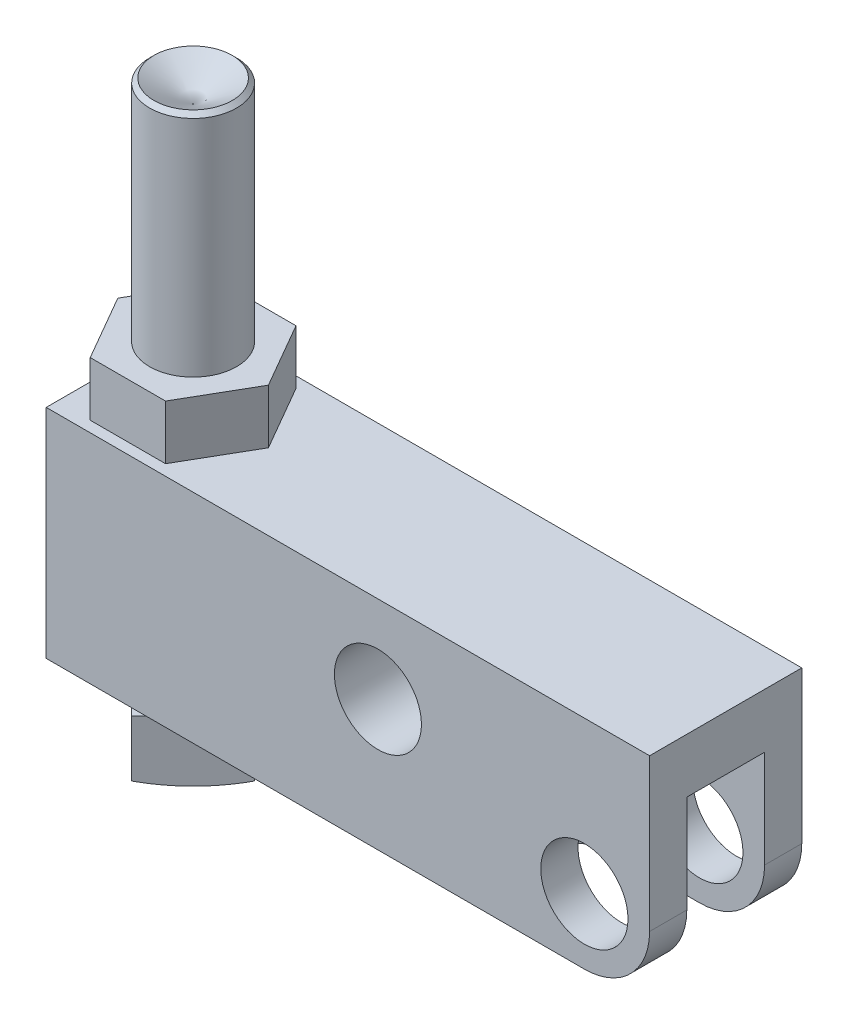
ISO-10303-21;
HEADER;
FILE_DESCRIPTION(('STEP AP214'),'2;1');
FILE_NAME('part.step','',(''),(''),'','','');
FILE_SCHEMA(('AUTOMOTIVE_DESIGN { 1 0 10303 214 1 1 1 1 }'));
ENDSEC;
DATA;
#1=APPLICATION_CONTEXT('core data for automotive mechanical design processes');
#2=APPLICATION_PROTOCOL_DEFINITION('international standard','automotive_design',2000,#1);
#3=PRODUCT_CONTEXT('',#1,'mechanical');
#4=PRODUCT('Part','Part','',(#3));
#5=PRODUCT_RELATED_PRODUCT_CATEGORY('part','',(#4));
#6=PRODUCT_DEFINITION_FORMATION('','',#4);
#7=PRODUCT_DEFINITION_CONTEXT('part definition',#1,'design');
#8=PRODUCT_DEFINITION('design','',#6,#7);
#9=PRODUCT_DEFINITION_SHAPE('','',#8);
#10=(LENGTH_UNIT() NAMED_UNIT(*) SI_UNIT(.MILLI.,.METRE.));
#11=(NAMED_UNIT(*) PLANE_ANGLE_UNIT() SI_UNIT($,.RADIAN.));
#12=(NAMED_UNIT(*) SI_UNIT($,.STERADIAN.) SOLID_ANGLE_UNIT());
#13=UNCERTAINTY_MEASURE_WITH_UNIT(LENGTH_MEASURE(1.E-05),#10,'distance_accuracy_value','');
#14=(GEOMETRIC_REPRESENTATION_CONTEXT(3) GLOBAL_UNCERTAINTY_ASSIGNED_CONTEXT((#13)) GLOBAL_UNIT_ASSIGNED_CONTEXT((#10,
#11,#12)) REPRESENTATION_CONTEXT('',''));
#15=CARTESIAN_POINT('',(0.,0.,0.));
#16=DIRECTION('',(0.,0.,1.));
#17=DIRECTION('',(1.,0.,0.));
#18=AXIS2_PLACEMENT_3D('',#15,#16,#17);
#19=CARTESIAN_POINT('',(-74.5998,-12.7,0.));
#20=DIRECTION('',(0.,1.,0.));
#21=DIRECTION('',(0.,0.,1.));
#22=AXIS2_PLACEMENT_3D('',#19,#20,#21);
#23=PLANE('',#22);
#24=DIRECTION('',(0.707106781186547,0.,0.707106781186548));
#25=VECTOR('',#24,1.);
#26=CARTESIAN_POINT('',(-77.2300561210691,-12.7,0.));
#27=LINE('',#26,#25);
#28=CARTESIAN_POINT('',(-72.7399280605346,-12.7,4.49012806053457));
#29=VERTEX_POINT('',#28);
#30=CARTESIAN_POINT('',(-68.2498,-12.7,8.98025612106915));
#31=VERTEX_POINT('',#30);
#32=EDGE_CURVE('E195',#29,#31,#27,.T.);
#33=ORIENTED_EDGE('',*,*,#32,.T.);
#34=DIRECTION('',(0.707106781186548,0.,-0.707106781186547));
#35=VECTOR('',#34,1.);
#36=CARTESIAN_POINT('',(-68.2498,-12.7,8.98025612106915));
#37=LINE('',#36,#35);
#38=CARTESIAN_POINT('',(-63.7596719394654,-12.7,4.49012806053458));
#39=VERTEX_POINT('',#38);
#40=EDGE_CURVE('E204',#31,#39,#37,.T.);
#41=ORIENTED_EDGE('',*,*,#40,.T.);
#42=CARTESIAN_POINT('',(-68.2498,-12.7,0.));
#43=DIRECTION('',(0.,1.,0.));
#44=DIRECTION('',(0.,0.,1.));
#45=AXIS2_PLACEMENT_3D('',#42,#43,#44);
#46=CIRCLE('',#45,6.34999999999999);
#47=EDGE_CURVE('E212',#29,#39,#46,.T.);
#48=ORIENTED_EDGE('',*,*,#47,.F.);
#49=EDGE_LOOP('',(#33,#41,#48));
#50=FACE_BOUND('',#49,.T.);
#51=ADVANCED_FACE('F34',(#50),#23,.T.);
#52=CARTESIAN_POINT('',(-63.7596719394654,-12.7,-4.49012806053458));
#53=VERTEX_POINT('',#52);
#54=EDGE_CURVE('E224',#39,#53,#46,.T.);
#55=ORIENTED_EDGE('',*,*,#54,.F.);
#56=CARTESIAN_POINT('',(-59.2695438789308,-12.7,0.));
#57=VERTEX_POINT('',#56);
#58=EDGE_CURVE('E207',#39,#57,#37,.T.);
#59=ORIENTED_EDGE('',*,*,#58,.T.);
#60=DIRECTION('',(-0.707106781186548,0.,-0.707106781186547));
#61=VECTOR('',#60,1.);
#62=CARTESIAN_POINT('',(-59.2695438789308,-12.7,0.));
#63=LINE('',#62,#61);
#64=EDGE_CURVE('E398',#57,#53,#63,.T.);
#65=ORIENTED_EDGE('',*,*,#64,.T.);
#66=EDGE_LOOP('',(#55,#59,#65));
#67=FACE_BOUND('',#66,.T.);
#68=ADVANCED_FACE('F404',(#67),#23,.T.);
#69=CARTESIAN_POINT('',(-72.7399280605346,-12.7,-4.49012806053458));
#70=VERTEX_POINT('',#69);
#71=EDGE_CURVE('E228',#53,#70,#46,.T.);
#72=ORIENTED_EDGE('',*,*,#71,.F.);
#73=CARTESIAN_POINT('',(-68.2498,-12.7,-8.98025612106915));
#74=VERTEX_POINT('',#73);
#75=EDGE_CURVE('E400',#53,#74,#63,.T.);
#76=ORIENTED_EDGE('',*,*,#75,.T.);
#77=DIRECTION('',(-0.707106781186547,0.,0.707106781186548));
#78=VECTOR('',#77,1.);
#79=CARTESIAN_POINT('',(-68.2498,-12.7,-8.98025612106915));
#80=LINE('',#79,#78);
#81=EDGE_CURVE('E214',#74,#70,#80,.T.);
#82=ORIENTED_EDGE('',*,*,#81,.T.);
#83=EDGE_LOOP('',(#72,#76,#82));
#84=FACE_BOUND('',#83,.T.);
#85=ADVANCED_FACE('F416',(#84),#23,.T.);
#86=CARTESIAN_POINT('',(-77.2300561210691,-12.7,0.));
#87=VERTEX_POINT('',#86);
#88=EDGE_CURVE('E217',#70,#87,#80,.T.);
#89=ORIENTED_EDGE('',*,*,#88,.T.);
#90=EDGE_CURVE('E49',#87,#29,#27,.T.);
#91=ORIENTED_EDGE('',*,*,#90,.T.);
#92=EDGE_CURVE('E410',#70,#29,#46,.T.);
#93=ORIENTED_EDGE('',*,*,#92,.F.);
#94=EDGE_LOOP('',(#89,#91,#93));
#95=FACE_BOUND('',#94,.T.);
#96=ADVANCED_FACE('F413',(#95),#23,.T.);
#97=CARTESIAN_POINT('',(-78.5876,22.225,11.1125));
#98=DIRECTION('',(0.,-1.,0.));
#99=DIRECTION('',(0.,0.,-1.));
#100=AXIS2_PLACEMENT_3D('',#97,#98,#99);
#101=PLANE('',#100);
#102=DIRECTION('',(0.500000000000001,0.,0.866025403784438));
#103=VECTOR('',#102,1.);
#104=CARTESIAN_POINT('',(-79.2483226280624,22.225,0.));
#105=LINE('',#104,#103);
#106=CARTESIAN_POINT('',(-78.5876,22.225,1.14440516151449));
#107=VERTEX_POINT('',#106);
#108=CARTESIAN_POINT('',(-73.7490613140312,22.225,9.52500000000001));
#109=VERTEX_POINT('',#108);
#110=EDGE_CURVE('E269',#107,#109,#105,.T.);
#111=ORIENTED_EDGE('',*,*,#110,.F.);
#112=DIRECTION('',(0.,0.,-1.));
#113=VECTOR('',#112,1.);
#114=CARTESIAN_POINT('',(-78.5876,22.225,11.1125));
#115=LINE('',#114,#113);
#116=CARTESIAN_POINT('',(-78.5876,22.225,11.1125));
#117=VERTEX_POINT('',#116);
#118=EDGE_CURVE('E354',#117,#107,#115,.T.);
#119=ORIENTED_EDGE('',*,*,#118,.F.);
#120=DIRECTION('',(-1.,0.,0.));
#121=VECTOR('',#120,1.);
#122=CARTESIAN_POINT('',(-78.5876,22.225,11.1125));
#123=LINE('',#122,#121);
#124=CARTESIAN_POINT('',(9.52499999999999,22.225,11.1125));
#125=VERTEX_POINT('',#124);
#126=EDGE_CURVE('E342',#125,#117,#123,.T.);
#127=ORIENTED_EDGE('',*,*,#126,.F.);
#128=DIRECTION('',(0.,0.,-1.));
#129=VECTOR('',#128,1.);
#130=CARTESIAN_POINT('',(9.52499999999999,22.225,11.1125));
#131=LINE('',#130,#129);
#132=CARTESIAN_POINT('',(9.52499999999999,22.225,-11.1125));
#133=VERTEX_POINT('',#132);
#134=EDGE_CURVE('E357',#125,#133,#131,.T.);
#135=ORIENTED_EDGE('',*,*,#134,.T.);
#136=DIRECTION('',(-1.,0.,0.));
#137=VECTOR('',#136,1.);
#138=CARTESIAN_POINT('',(-78.5876,22.225,-11.1125));
#139=LINE('',#138,#137);
#140=CARTESIAN_POINT('',(-78.5876,22.225,-11.1125));
#141=VERTEX_POINT('',#140);
#142=EDGE_CURVE('E337',#133,#141,#139,.T.);
#143=ORIENTED_EDGE('',*,*,#142,.T.);
#144=CARTESIAN_POINT('',(-78.5876,22.225,-1.14440516151446));
#145=VERTEX_POINT('',#144);
#146=EDGE_CURVE('E344',#145,#141,#115,.T.);
#147=ORIENTED_EDGE('',*,*,#146,.F.);
#148=DIRECTION('',(-0.5,0.,0.866025403784439));
#149=VECTOR('',#148,1.);
#150=CARTESIAN_POINT('',(-73.7490613140312,22.225,-9.52499999999999));
#151=LINE('',#150,#149);
#152=CARTESIAN_POINT('',(-73.7490613140312,22.225,-9.52499999999999));
#153=VERTEX_POINT('',#152);
#154=EDGE_CURVE('E263',#153,#145,#151,.T.);
#155=ORIENTED_EDGE('',*,*,#154,.F.);
#156=DIRECTION('',(-1.,0.,0.));
#157=VECTOR('',#156,1.);
#158=CARTESIAN_POINT('',(-62.7505386859688,22.225,-9.52499999999999));
#159=LINE('',#158,#157);
#160=CARTESIAN_POINT('',(-62.7505386859688,22.225,-9.52499999999999));
#161=VERTEX_POINT('',#160);
#162=EDGE_CURVE('E259',#161,#153,#159,.T.);
#163=ORIENTED_EDGE('',*,*,#162,.F.);
#164=DIRECTION('',(-0.5,0.,-0.866025403784439));
#165=VECTOR('',#164,1.);
#166=CARTESIAN_POINT('',(-57.2512773719376,22.225,0.));
#167=LINE('',#166,#165);
#168=CARTESIAN_POINT('',(-57.2512773719376,22.225,0.));
#169=VERTEX_POINT('',#168);
#170=EDGE_CURVE('E256',#169,#161,#167,.T.);
#171=ORIENTED_EDGE('',*,*,#170,.F.);
#172=DIRECTION('',(0.500000000000001,0.,-0.866025403784438));
#173=VECTOR('',#172,1.);
#174=CARTESIAN_POINT('',(-62.7505386859688,22.225,9.52500000000001));
#175=LINE('',#174,#173);
#176=CARTESIAN_POINT('',(-62.7505386859688,22.225,9.52500000000001));
#177=VERTEX_POINT('',#176);
#178=EDGE_CURVE('E238',#177,#169,#175,.T.);
#179=ORIENTED_EDGE('',*,*,#178,.F.);
#180=DIRECTION('',(1.,0.,0.));
#181=VECTOR('',#180,1.);
#182=CARTESIAN_POINT('',(-73.7490613140312,22.225,9.52500000000001));
#183=LINE('',#182,#181);
#184=EDGE_CURVE('E243',#109,#177,#183,.T.);
#185=ORIENTED_EDGE('',*,*,#184,.F.);
#186=EDGE_LOOP('',(#111,#119,#127,#135,#143,#147,#155,#163,#171,#179,#185));
#187=FACE_BOUND('',#186,.T.);
#188=ADVANCED_FACE('F423',(#187),#101,.F.);
#189=CARTESIAN_POINT('',(0.,0.,11.1125));
#190=DIRECTION('',(0.,0.,-1.));
#191=DIRECTION('',(-1.,0.,0.));
#192=AXIS2_PLACEMENT_3D('',#189,#190,#191);
#193=CYLINDRICAL_SURFACE('',#192,6.36905);
#194=CARTESIAN_POINT('',(0.,0.,5.6769));
#195=DIRECTION('',(0.,0.,1.));
#196=DIRECTION('',(1.,0.,0.));
#197=AXIS2_PLACEMENT_3D('',#194,#195,#196);
#198=CIRCLE('',#197,6.36905);
#199=CARTESIAN_POINT('',(6.36905,0.,5.6769));
#200=VERTEX_POINT('',#199);
#201=EDGE_CURVE('E326',#200,#200,#198,.T.);
#202=ORIENTED_EDGE('',*,*,#201,.F.);
#203=EDGE_LOOP('',(#202));
#204=FACE_BOUND('',#203,.T.);
#205=CARTESIAN_POINT('',(0.,0.,11.1125));
#206=DIRECTION('',(0.,0.,1.));
#207=DIRECTION('',(1.,0.,0.));
#208=AXIS2_PLACEMENT_3D('',#205,#206,#207);
#209=CIRCLE('',#208,6.36905);
#210=CARTESIAN_POINT('',(6.36905,0.,11.1125));
#211=VERTEX_POINT('',#210);
#212=EDGE_CURVE('E327',#211,#211,#209,.T.);
#213=ORIENTED_EDGE('',*,*,#212,.T.);
#214=EDGE_LOOP('',(#213));
#215=FACE_BOUND('',#214,.T.);
#216=ADVANCED_FACE('F448',(#204,#215),#193,.F.);
#217=CARTESIAN_POINT('',(-78.5876,-9.525,11.1125));
#218=DIRECTION('',(0.,0.,1.));
#219=DIRECTION('',(1.,0.,0.));
#220=AXIS2_PLACEMENT_3D('',#217,#218,#219);
#221=PLANE('',#220);
#222=ORIENTED_EDGE('',*,*,#212,.F.);
#223=EDGE_LOOP('',(#222));
#224=FACE_BOUND('',#223,.T.);
#225=DIRECTION('',(1.,0.,0.));
#226=VECTOR('',#225,1.);
#227=CARTESIAN_POINT('',(-78.5876,-9.525,11.1125));
#228=LINE('',#227,#226);
#229=CARTESIAN_POINT('',(-78.5876,-9.525,11.1125));
#230=VERTEX_POINT('',#229);
#231=CARTESIAN_POINT('',(0.,-9.525,11.1125));
#232=VERTEX_POINT('',#231);
#233=EDGE_CURVE('E336',#230,#232,#228,.T.);
#234=ORIENTED_EDGE('',*,*,#233,.T.);
#235=CARTESIAN_POINT('',(0.,0.,11.1125));
#236=DIRECTION('',(0.,0.,1.));
#237=DIRECTION('',(1.,0.,0.));
#238=AXIS2_PLACEMENT_3D('',#235,#236,#237);
#239=CIRCLE('',#238,9.525);
#240=CARTESIAN_POINT('',(9.52499999999999,0.,11.1125));
#241=VERTEX_POINT('',#240);
#242=EDGE_CURVE('E384',#232,#241,#239,.T.);
#243=ORIENTED_EDGE('',*,*,#242,.T.);
#244=DIRECTION('',(0.,1.,0.));
#245=VECTOR('',#244,1.);
#246=CARTESIAN_POINT('',(9.52499999999999,22.225,11.1125));
#247=LINE('',#246,#245);
#248=EDGE_CURVE('E340',#241,#125,#247,.T.);
#249=ORIENTED_EDGE('',*,*,#248,.T.);
#250=ORIENTED_EDGE('',*,*,#126,.T.);
#251=DIRECTION('',(0.,-1.,0.));
#252=VECTOR('',#251,1.);
#253=CARTESIAN_POINT('',(-78.5876,22.225,11.1125));
#254=LINE('',#253,#252);
#255=EDGE_CURVE('E333',#117,#230,#254,.T.);
#256=ORIENTED_EDGE('',*,*,#255,.T.);
#257=EDGE_LOOP('',(#234,#243,#249,#250,#256));
#258=FACE_BOUND('',#257,.T.);
#259=CARTESIAN_POINT('',(-30.1498,9.525,11.1125));
#260=DIRECTION('',(0.,0.,1.));
#261=DIRECTION('',(1.,0.,0.));
#262=AXIS2_PLACEMENT_3D('',#259,#260,#261);
#263=CIRCLE('',#262,6.35635);
#264=CARTESIAN_POINT('',(-23.79345,9.525,11.1125));
#265=VERTEX_POINT('',#264);
#266=EDGE_CURVE('E319',#265,#265,#263,.T.);
#267=ORIENTED_EDGE('',*,*,#266,.F.);
#268=EDGE_LOOP('',(#267));
#269=FACE_BOUND('',#268,.T.);
#270=ADVANCED_FACE('F459',(#224,#258,#269),#221,.T.);
#271=CARTESIAN_POINT('',(-78.5876,-9.525,-11.1125));
#272=DIRECTION('',(0.,0.,1.));
#273=DIRECTION('',(1.,0.,0.));
#274=AXIS2_PLACEMENT_3D('',#271,#272,#273);
#275=PLANE('',#274);
#276=CARTESIAN_POINT('',(0.,0.,-11.1125));
#277=DIRECTION('',(0.,0.,1.));
#278=DIRECTION('',(1.,0.,0.));
#279=AXIS2_PLACEMENT_3D('',#276,#277,#278);
#280=CIRCLE('',#279,6.36905);
#281=CARTESIAN_POINT('',(6.36905,0.,-11.1125));
#282=VERTEX_POINT('',#281);
#283=EDGE_CURVE('E322',#282,#282,#280,.T.);
#284=ORIENTED_EDGE('',*,*,#283,.T.);
#285=EDGE_LOOP('',(#284));
#286=FACE_BOUND('',#285,.T.);
#287=DIRECTION('',(0.,1.,0.));
#288=VECTOR('',#287,1.);
#289=CARTESIAN_POINT('',(9.52499999999999,22.225,-11.1125));
#290=LINE('',#289,#288);
#291=CARTESIAN_POINT('',(9.52499999999999,0.,-11.1125));
#292=VERTEX_POINT('',#291);
#293=EDGE_CURVE('E350',#292,#133,#290,.T.);
#294=ORIENTED_EDGE('',*,*,#293,.F.);
#295=CARTESIAN_POINT('',(0.,0.,-11.1125));
#296=DIRECTION('',(0.,0.,1.));
#297=DIRECTION('',(1.,0.,0.));
#298=AXIS2_PLACEMENT_3D('',#295,#296,#297);
#299=CIRCLE('',#298,9.525);
#300=CARTESIAN_POINT('',(0.,-9.525,-11.1125));
#301=VERTEX_POINT('',#300);
#302=EDGE_CURVE('E374',#292,#301,#299,.F.);
#303=ORIENTED_EDGE('',*,*,#302,.T.);
#304=DIRECTION('',(1.,0.,0.));
#305=VECTOR('',#304,1.);
#306=CARTESIAN_POINT('',(-78.5876,-9.525,-11.1125));
#307=LINE('',#306,#305);
#308=CARTESIAN_POINT('',(-78.5876,-9.525,-11.1125));
#309=VERTEX_POINT('',#308);
#310=EDGE_CURVE('E347',#309,#301,#307,.T.);
#311=ORIENTED_EDGE('',*,*,#310,.F.);
#312=DIRECTION('',(0.,-1.,0.));
#313=VECTOR('',#312,1.);
#314=CARTESIAN_POINT('',(-78.5876,22.225,-11.1125));
#315=LINE('',#314,#313);
#316=EDGE_CURVE('E330',#141,#309,#315,.T.);
#317=ORIENTED_EDGE('',*,*,#316,.F.);
#318=ORIENTED_EDGE('',*,*,#142,.F.);
#319=EDGE_LOOP('',(#294,#303,#311,#317,#318));
#320=FACE_BOUND('',#319,.T.);
#321=CARTESIAN_POINT('',(-30.1498,9.525,-11.1125));
#322=DIRECTION('',(0.,0.,1.));
#323=DIRECTION('',(1.,0.,0.));
#324=AXIS2_PLACEMENT_3D('',#321,#322,#323);
#325=CIRCLE('',#324,6.35635);
#326=CARTESIAN_POINT('',(-23.79345,9.525,-11.1125));
#327=VERTEX_POINT('',#326);
#328=EDGE_CURVE('E323',#327,#327,#325,.T.);
#329=ORIENTED_EDGE('',*,*,#328,.T.);
#330=EDGE_LOOP('',(#329));
#331=FACE_BOUND('',#330,.T.);
#332=ADVANCED_FACE('F471',(#286,#320,#331),#275,.F.);
#333=CARTESIAN_POINT('',(-78.5876,22.225,11.1125));
#334=DIRECTION('',(1.,0.,0.));
#335=DIRECTION('',(0.,0.,-1.));
#336=AXIS2_PLACEMENT_3D('',#333,#334,#335);
#337=PLANE('',#336);
#338=ORIENTED_EDGE('',*,*,#316,.T.);
#339=DIRECTION('',(0.,0.,-1.));
#340=VECTOR('',#339,1.);
#341=CARTESIAN_POINT('',(-78.5876,-9.525,11.1125));
#342=LINE('',#341,#340);
#343=EDGE_CURVE('E361',#230,#309,#342,.T.);
#344=ORIENTED_EDGE('',*,*,#343,.F.);
#345=ORIENTED_EDGE('',*,*,#255,.F.);
#346=ORIENTED_EDGE('',*,*,#118,.T.);
#347=EDGE_CURVE('E358',#107,#145,#115,.T.);
#348=ORIENTED_EDGE('',*,*,#347,.T.);
#349=ORIENTED_EDGE('',*,*,#146,.T.);
#350=EDGE_LOOP('',(#338,#344,#345,#346,#348,#349));
#351=FACE_BOUND('',#350,.T.);
#352=ADVANCED_FACE('F481',(#351),#337,.F.);
#353=CARTESIAN_POINT('',(-78.5876,-9.525,11.1125));
#354=DIRECTION('',(0.,1.,0.));
#355=DIRECTION('',(0.,0.,1.));
#356=AXIS2_PLACEMENT_3D('',#353,#354,#355);
#357=PLANE('',#356);
#358=CARTESIAN_POINT('',(-68.2498,-9.525,0.));
#359=DIRECTION('',(0.,1.,0.));
#360=DIRECTION('',(0.,0.,1.));
#361=AXIS2_PLACEMENT_3D('',#358,#359,#360);
#362=CIRCLE('',#361,6.34999999999999);
#363=CARTESIAN_POINT('',(-68.2498,-9.525,6.34999999999999));
#364=VERTEX_POINT('',#363);
#365=EDGE_CURVE('E235',#364,#364,#362,.T.);
#366=ORIENTED_EDGE('',*,*,#365,.T.);
#367=EDGE_LOOP('',(#366));
#368=FACE_BOUND('',#367,.T.);
#369=ORIENTED_EDGE('',*,*,#310,.T.);
#370=DIRECTION('',(0.,0.,-1.));
#371=VECTOR('',#370,1.);
#372=CARTESIAN_POINT('',(0.,-9.525,11.1125));
#373=LINE('',#372,#371);
#374=CARTESIAN_POINT('',(0.,-9.525,-5.6769));
#375=VERTEX_POINT('',#374);
#376=EDGE_CURVE('E378',#301,#375,#373,.F.);
#377=ORIENTED_EDGE('',*,*,#376,.T.);
#378=DIRECTION('',(1.,0.,0.));
#379=VECTOR('',#378,1.);
#380=CARTESIAN_POINT('',(-12.7127,-9.525,-5.6769));
#381=LINE('',#380,#379);
#382=CARTESIAN_POINT('',(-12.7127,-9.525,-5.6769));
#383=VERTEX_POINT('',#382);
#384=EDGE_CURVE('E304',#383,#375,#381,.T.);
#385=ORIENTED_EDGE('',*,*,#384,.F.);
#386=CARTESIAN_POINT('',(-12.7127,-9.525,0.));
#387=DIRECTION('',(0.,-1.,0.));
#388=DIRECTION('',(0.,0.,-1.));
#389=AXIS2_PLACEMENT_3D('',#386,#387,#388);
#390=CIRCLE('',#389,5.6769);
#391=CARTESIAN_POINT('',(-12.7127,-9.525,5.6769));
#392=VERTEX_POINT('',#391);
#393=EDGE_CURVE('E289',#392,#383,#390,.T.);
#394=ORIENTED_EDGE('',*,*,#393,.F.);
#395=DIRECTION('',(-1.,0.,0.));
#396=VECTOR('',#395,1.);
#397=CARTESIAN_POINT('',(-12.7127,-9.525,5.6769));
#398=LINE('',#397,#396);
#399=CARTESIAN_POINT('',(0.,-9.525,5.6769));
#400=VERTEX_POINT('',#399);
#401=EDGE_CURVE('E294',#400,#392,#398,.T.);
#402=ORIENTED_EDGE('',*,*,#401,.F.);
#403=DIRECTION('',(0.,0.,-1.));
#404=VECTOR('',#403,1.);
#405=CARTESIAN_POINT('',(0.,-9.525,11.1125));
#406=LINE('',#405,#404);
#407=EDGE_CURVE('E376',#400,#232,#406,.F.);
#408=ORIENTED_EDGE('',*,*,#407,.T.);
#409=ORIENTED_EDGE('',*,*,#233,.F.);
#410=ORIENTED_EDGE('',*,*,#343,.T.);
#411=EDGE_LOOP('',(#369,#377,#385,#394,#402,#408,#409,#410));
#412=FACE_BOUND('',#411,.T.);
#413=ADVANCED_FACE('F490',(#368,#412),#357,.F.);
#414=CARTESIAN_POINT('',(9.52499999999999,22.225,11.1125));
#415=DIRECTION('',(-1.,0.,0.));
#416=DIRECTION('',(0.,0.,1.));
#417=AXIS2_PLACEMENT_3D('',#414,#415,#416);
#418=PLANE('',#417);
#419=DIRECTION('',(0.,-1.,0.));
#420=VECTOR('',#419,1.);
#421=CARTESIAN_POINT('',(9.525,14.2748,-5.6769));
#422=LINE('',#421,#420);
#423=CARTESIAN_POINT('',(9.52499999999999,14.2748,-5.6769));
#424=VERTEX_POINT('',#423);
#425=CARTESIAN_POINT('',(9.525,0.,-5.6769));
#426=VERTEX_POINT('',#425);
#427=EDGE_CURVE('E315',#424,#426,#422,.T.);
#428=ORIENTED_EDGE('',*,*,#427,.T.);
#429=DIRECTION('',(0.,0.,-1.));
#430=VECTOR('',#429,1.);
#431=CARTESIAN_POINT('',(9.52499999999999,0.,11.1125));
#432=LINE('',#431,#430);
#433=EDGE_CURVE('E371',#426,#292,#432,.T.);
#434=ORIENTED_EDGE('',*,*,#433,.T.);
#435=ORIENTED_EDGE('',*,*,#293,.T.);
#436=ORIENTED_EDGE('',*,*,#134,.F.);
#437=ORIENTED_EDGE('',*,*,#248,.F.);
#438=DIRECTION('',(0.,0.,-1.));
#439=VECTOR('',#438,1.);
#440=CARTESIAN_POINT('',(9.52499999999999,0.,11.1125));
#441=LINE('',#440,#439);
#442=CARTESIAN_POINT('',(9.525,0.,5.6769));
#443=VERTEX_POINT('',#442);
#444=EDGE_CURVE('E364',#241,#443,#441,.T.);
#445=ORIENTED_EDGE('',*,*,#444,.T.);
#446=DIRECTION('',(0.,-1.,0.));
#447=VECTOR('',#446,1.);
#448=CARTESIAN_POINT('',(9.525,14.2748,5.6769));
#449=LINE('',#448,#447);
#450=CARTESIAN_POINT('',(9.525,14.2748,5.6769));
#451=VERTEX_POINT('',#450);
#452=EDGE_CURVE('E312',#451,#443,#449,.T.);
#453=ORIENTED_EDGE('',*,*,#452,.F.);
#454=DIRECTION('',(0.,0.,1.));
#455=VECTOR('',#454,1.);
#456=CARTESIAN_POINT('',(9.525,14.2748,5.6769));
#457=LINE('',#456,#455);
#458=EDGE_CURVE('E296',#424,#451,#457,.T.);
#459=ORIENTED_EDGE('',*,*,#458,.F.);
#460=EDGE_LOOP('',(#428,#434,#435,#436,#437,#445,#453,#459));
#461=FACE_BOUND('',#460,.T.);
#462=ADVANCED_FACE('F500',(#461),#418,.F.);
#463=CARTESIAN_POINT('',(0.,0.,-5.6769));
#464=DIRECTION('',(0.,0.,-1.));
#465=DIRECTION('',(-1.,0.,0.));
#466=AXIS2_PLACEMENT_3D('',#463,#464,#465);
#467=CIRCLE('',#466,6.36905);
#468=CARTESIAN_POINT('',(-6.36905,0.,-5.6769));
#469=VERTEX_POINT('',#468);
#470=EDGE_CURVE('E311',#469,#469,#467,.T.);
#471=ORIENTED_EDGE('',*,*,#470,.F.);
#472=EDGE_LOOP('',(#471));
#473=FACE_BOUND('',#472,.T.);
#474=ORIENTED_EDGE('',*,*,#283,.F.);
#475=EDGE_LOOP('',(#474));
#476=FACE_BOUND('',#475,.T.);
#477=ADVANCED_FACE('F462',(#473,#476),#193,.F.);
#478=CARTESIAN_POINT('',(-30.1498,9.525,11.1125));
#479=DIRECTION('',(0.,0.,-1.));
#480=DIRECTION('',(-1.,0.,0.));
#481=AXIS2_PLACEMENT_3D('',#478,#479,#480);
#482=CYLINDRICAL_SURFACE('',#481,6.35635);
#483=ORIENTED_EDGE('',*,*,#266,.T.);
#484=EDGE_LOOP('',(#483));
#485=FACE_BOUND('',#484,.T.);
#486=ORIENTED_EDGE('',*,*,#328,.F.);
#487=EDGE_LOOP('',(#486));
#488=FACE_BOUND('',#487,.T.);
#489=ADVANCED_FACE('F518',(#485,#488),#482,.F.);
#490=CARTESIAN_POINT('',(-12.7127,14.2748,0.));
#491=DIRECTION('',(0.,-1.,0.));
#492=DIRECTION('',(0.,0.,-1.));
#493=AXIS2_PLACEMENT_3D('',#490,#491,#492);
#494=CYLINDRICAL_SURFACE('',#493,5.6769);
#495=ORIENTED_EDGE('',*,*,#393,.T.);
#496=DIRECTION('',(0.,-1.,0.));
#497=VECTOR('',#496,1.);
#498=CARTESIAN_POINT('',(-12.7127,14.2748,-5.6769));
#499=LINE('',#498,#497);
#500=CARTESIAN_POINT('',(-12.7127,14.2748,-5.6769));
#501=VERTEX_POINT('',#500);
#502=EDGE_CURVE('E301',#501,#383,#499,.T.);
#503=ORIENTED_EDGE('',*,*,#502,.F.);
#504=CARTESIAN_POINT('',(-12.7127,14.2748,0.));
#505=DIRECTION('',(0.,-1.,0.));
#506=DIRECTION('',(0.,0.,-1.));
#507=AXIS2_PLACEMENT_3D('',#504,#505,#506);
#508=CIRCLE('',#507,5.6769);
#509=CARTESIAN_POINT('',(-12.7127,14.2748,5.6769));
#510=VERTEX_POINT('',#509);
#511=EDGE_CURVE('E290',#510,#501,#508,.T.);
#512=ORIENTED_EDGE('',*,*,#511,.F.);
#513=DIRECTION('',(0.,-1.,0.));
#514=VECTOR('',#513,1.);
#515=CARTESIAN_POINT('',(-12.7127,14.2748,5.6769));
#516=LINE('',#515,#514);
#517=EDGE_CURVE('E308',#510,#392,#516,.T.);
#518=ORIENTED_EDGE('',*,*,#517,.T.);
#519=EDGE_LOOP('',(#495,#503,#512,#518));
#520=FACE_BOUND('',#519,.T.);
#521=ADVANCED_FACE('F526',(#520),#494,.F.);
#522=CARTESIAN_POINT('',(-12.7127,14.2748,5.6769));
#523=DIRECTION('',(0.,0.,1.));
#524=DIRECTION('',(1.,0.,0.));
#525=AXIS2_PLACEMENT_3D('',#522,#523,#524);
#526=PLANE('',#525);
#527=ORIENTED_EDGE('',*,*,#201,.T.);
#528=EDGE_LOOP('',(#527));
#529=FACE_BOUND('',#528,.T.);
#530=ORIENTED_EDGE('',*,*,#452,.T.);
#531=CARTESIAN_POINT('',(0.,0.,5.6769));
#532=DIRECTION('',(0.,0.,1.));
#533=DIRECTION('',(1.,0.,0.));
#534=AXIS2_PLACEMENT_3D('',#531,#532,#533);
#535=CIRCLE('',#534,9.525);
#536=EDGE_CURVE('E382',#443,#400,#535,.F.);
#537=ORIENTED_EDGE('',*,*,#536,.T.);
#538=ORIENTED_EDGE('',*,*,#401,.T.);
#539=ORIENTED_EDGE('',*,*,#517,.F.);
#540=DIRECTION('',(-1.,0.,0.));
#541=VECTOR('',#540,1.);
#542=CARTESIAN_POINT('',(-12.7127,14.2748,5.6769));
#543=LINE('',#542,#541);
#544=EDGE_CURVE('E298',#451,#510,#543,.T.);
#545=ORIENTED_EDGE('',*,*,#544,.F.);
#546=EDGE_LOOP('',(#530,#537,#538,#539,#545));
#547=FACE_BOUND('',#546,.T.);
#548=ADVANCED_FACE('F534',(#529,#547),#526,.F.);
#549=CARTESIAN_POINT('',(-12.7127,14.2748,-5.6769));
#550=DIRECTION('',(0.,0.,-1.));
#551=DIRECTION('',(-1.,0.,0.));
#552=AXIS2_PLACEMENT_3D('',#549,#550,#551);
#553=PLANE('',#552);
#554=ORIENTED_EDGE('',*,*,#470,.T.);
#555=EDGE_LOOP('',(#554));
#556=FACE_BOUND('',#555,.T.);
#557=ORIENTED_EDGE('',*,*,#384,.T.);
#558=CARTESIAN_POINT('',(0.,0.,-5.6769));
#559=DIRECTION('',(0.,0.,-1.));
#560=DIRECTION('',(-1.,0.,0.));
#561=AXIS2_PLACEMENT_3D('',#558,#559,#560);
#562=CIRCLE('',#561,9.525);
#563=EDGE_CURVE('E380',#375,#426,#562,.F.);
#564=ORIENTED_EDGE('',*,*,#563,.T.);
#565=ORIENTED_EDGE('',*,*,#427,.F.);
#566=DIRECTION('',(1.,0.,0.));
#567=VECTOR('',#566,1.);
#568=CARTESIAN_POINT('',(-12.7127,14.2748,-5.6769));
#569=LINE('',#568,#567);
#570=EDGE_CURVE('E293',#501,#424,#569,.T.);
#571=ORIENTED_EDGE('',*,*,#570,.F.);
#572=ORIENTED_EDGE('',*,*,#502,.T.);
#573=EDGE_LOOP('',(#557,#564,#565,#571,#572));
#574=FACE_BOUND('',#573,.T.);
#575=ADVANCED_FACE('F542',(#556,#574),#553,.F.);
#576=CARTESIAN_POINT('',(-12.7127,14.2748,0.));
#577=DIRECTION('',(0.,-1.,0.));
#578=DIRECTION('',(0.,0.,-1.));
#579=AXIS2_PLACEMENT_3D('',#576,#577,#578);
#580=PLANE('',#579);
#581=ORIENTED_EDGE('',*,*,#511,.T.);
#582=ORIENTED_EDGE('',*,*,#570,.T.);
#583=ORIENTED_EDGE('',*,*,#458,.T.);
#584=ORIENTED_EDGE('',*,*,#544,.T.);
#585=EDGE_LOOP('',(#581,#582,#583,#584));
#586=FACE_BOUND('',#585,.T.);
#587=ADVANCED_FACE('F551',(#586),#580,.T.);
#588=CARTESIAN_POINT('',(0.,0.,11.1125));
#589=DIRECTION('',(0.,0.,-1.));
#590=DIRECTION('',(-1.,0.,0.));
#591=AXIS2_PLACEMENT_3D('',#588,#589,#590);
#592=CYLINDRICAL_SURFACE('',#591,9.525);
#593=ORIENTED_EDGE('',*,*,#563,.F.);
#594=ORIENTED_EDGE('',*,*,#376,.F.);
#595=ORIENTED_EDGE('',*,*,#302,.F.);
#596=ORIENTED_EDGE('',*,*,#433,.F.);
#597=EDGE_LOOP('',(#593,#594,#595,#596));
#598=FACE_BOUND('',#597,.T.);
#599=ADVANCED_FACE('F560',(#598),#592,.T.);
#600=CARTESIAN_POINT('',(0.,0.,11.1125));
#601=DIRECTION('',(0.,0.,-1.));
#602=DIRECTION('',(-1.,0.,0.));
#603=AXIS2_PLACEMENT_3D('',#600,#601,#602);
#604=CYLINDRICAL_SURFACE('',#603,9.525);
#605=ORIENTED_EDGE('',*,*,#242,.F.);
#606=ORIENTED_EDGE('',*,*,#407,.F.);
#607=ORIENTED_EDGE('',*,*,#536,.F.);
#608=ORIENTED_EDGE('',*,*,#444,.F.);
#609=EDGE_LOOP('',(#605,#606,#607,#608));
#610=FACE_BOUND('',#609,.T.);
#611=ADVANCED_FACE('F36',(#610),#604,.T.);
#612=CARTESIAN_POINT('',(-68.2498,22.225,19.05));
#613=DIRECTION('',(0.,-1.,0.));
#614=DIRECTION('',(0.,0.,-1.));
#615=AXIS2_PLACEMENT_3D('',#612,#613,#614);
#616=PLANE('',#615);
#617=ORIENTED_EDGE('',*,*,#347,.F.);
#618=CARTESIAN_POINT('',(-79.2483226280624,22.225,0.));
#619=VERTEX_POINT('',#618);
#620=EDGE_CURVE('E266',#619,#107,#105,.T.);
#621=ORIENTED_EDGE('',*,*,#620,.F.);
#622=EDGE_CURVE('E262',#145,#619,#151,.T.);
#623=ORIENTED_EDGE('',*,*,#622,.F.);
#624=EDGE_LOOP('',(#617,#621,#623));
#625=FACE_BOUND('',#624,.T.);
#626=ADVANCED_FACE('F574',(#625),#616,.T.);
#627=CARTESIAN_POINT('',(-62.7505386859688,30.1498,9.52500000000001));
#628=DIRECTION('',(-0.866025403784438,0.,-0.500000000000001));
#629=DIRECTION('',(-0.500000000000001,0.,0.866025403784438));
#630=AXIS2_PLACEMENT_3D('',#627,#628,#629);
#631=PLANE('',#630);
#632=ORIENTED_EDGE('',*,*,#178,.T.);
#633=DIRECTION('',(0.,-1.,0.));
#634=VECTOR('',#633,1.);
#635=CARTESIAN_POINT('',(-57.2512773719376,30.1498,0.));
#636=LINE('',#635,#634);
#637=CARTESIAN_POINT('',(-57.2512773719376,30.1498,0.));
#638=VERTEX_POINT('',#637);
#639=EDGE_CURVE('E286',#638,#169,#636,.T.);
#640=ORIENTED_EDGE('',*,*,#639,.F.);
#641=DIRECTION('',(0.500000000000001,0.,-0.866025403784438));
#642=VECTOR('',#641,1.);
#643=CARTESIAN_POINT('',(-62.7505386859688,30.1498,9.52500000000001));
#644=LINE('',#643,#642);
#645=CARTESIAN_POINT('',(-62.7505386859688,30.1498,9.52500000000001));
#646=VERTEX_POINT('',#645);
#647=EDGE_CURVE('E239',#646,#638,#644,.T.);
#648=ORIENTED_EDGE('',*,*,#647,.F.);
#649=DIRECTION('',(0.,-1.,0.));
#650=VECTOR('',#649,1.);
#651=CARTESIAN_POINT('',(-62.7505386859688,30.1498,9.52500000000001));
#652=LINE('',#651,#650);
#653=EDGE_CURVE('E253',#646,#177,#652,.T.);
#654=ORIENTED_EDGE('',*,*,#653,.T.);
#655=EDGE_LOOP('',(#632,#640,#648,#654));
#656=FACE_BOUND('',#655,.T.);
#657=ADVANCED_FACE('F581',(#656),#631,.F.);
#658=CARTESIAN_POINT('',(-57.2512773719376,30.1498,0.));
#659=DIRECTION('',(-0.866025403784439,0.,0.5));
#660=DIRECTION('',(0.5,0.,0.866025403784439));
#661=AXIS2_PLACEMENT_3D('',#658,#659,#660);
#662=PLANE('',#661);
#663=ORIENTED_EDGE('',*,*,#170,.T.);
#664=DIRECTION('',(0.,-1.,0.));
#665=VECTOR('',#664,1.);
#666=CARTESIAN_POINT('',(-62.7505386859688,30.1498,-9.52499999999999));
#667=LINE('',#666,#665);
#668=CARTESIAN_POINT('',(-62.7505386859688,30.1498,-9.52499999999999));
#669=VERTEX_POINT('',#668);
#670=EDGE_CURVE('E283',#669,#161,#667,.T.);
#671=ORIENTED_EDGE('',*,*,#670,.F.);
#672=DIRECTION('',(-0.5,0.,-0.866025403784439));
#673=VECTOR('',#672,1.);
#674=CARTESIAN_POINT('',(-57.2512773719376,30.1498,0.));
#675=LINE('',#674,#673);
#676=EDGE_CURVE('E242',#638,#669,#675,.T.);
#677=ORIENTED_EDGE('',*,*,#676,.F.);
#678=ORIENTED_EDGE('',*,*,#639,.T.);
#679=EDGE_LOOP('',(#663,#671,#677,#678));
#680=FACE_BOUND('',#679,.T.);
#681=ADVANCED_FACE('F590',(#680),#662,.F.);
#682=CARTESIAN_POINT('',(-62.7505386859688,30.1498,-9.52499999999999));
#683=DIRECTION('',(0.,0.,1.));
#684=DIRECTION('',(1.,0.,0.));
#685=AXIS2_PLACEMENT_3D('',#682,#683,#684);
#686=PLANE('',#685);
#687=ORIENTED_EDGE('',*,*,#162,.T.);
#688=DIRECTION('',(0.,-1.,0.));
#689=VECTOR('',#688,1.);
#690=CARTESIAN_POINT('',(-73.7490613140312,30.1498,-9.52499999999999));
#691=LINE('',#690,#689);
#692=CARTESIAN_POINT('',(-73.7490613140312,30.1498,-9.52499999999999));
#693=VERTEX_POINT('',#692);
#694=EDGE_CURVE('E280',#693,#153,#691,.T.);
#695=ORIENTED_EDGE('',*,*,#694,.F.);
#696=DIRECTION('',(-1.,0.,0.));
#697=VECTOR('',#696,1.);
#698=CARTESIAN_POINT('',(-62.7505386859688,30.1498,-9.52499999999999));
#699=LINE('',#698,#697);
#700=EDGE_CURVE('E245',#669,#693,#699,.T.);
#701=ORIENTED_EDGE('',*,*,#700,.F.);
#702=ORIENTED_EDGE('',*,*,#670,.T.);
#703=EDGE_LOOP('',(#687,#695,#701,#702));
#704=FACE_BOUND('',#703,.T.);
#705=ADVANCED_FACE('F599',(#704),#686,.F.);
#706=CARTESIAN_POINT('',(-73.7490613140312,30.1498,-9.52499999999999));
#707=DIRECTION('',(0.866025403784439,0.,0.5));
#708=DIRECTION('',(0.5,0.,-0.866025403784439));
#709=AXIS2_PLACEMENT_3D('',#706,#707,#708);
#710=PLANE('',#709);
#711=ORIENTED_EDGE('',*,*,#154,.T.);
#712=ORIENTED_EDGE('',*,*,#622,.T.);
#713=DIRECTION('',(0.,-1.,0.));
#714=VECTOR('',#713,1.);
#715=CARTESIAN_POINT('',(-79.2483226280624,30.1498,0.));
#716=LINE('',#715,#714);
#717=CARTESIAN_POINT('',(-79.2483226280624,30.1498,0.));
#718=VERTEX_POINT('',#717);
#719=EDGE_CURVE('E277',#718,#619,#716,.T.);
#720=ORIENTED_EDGE('',*,*,#719,.F.);
#721=DIRECTION('',(-0.5,0.,0.866025403784439));
#722=VECTOR('',#721,1.);
#723=CARTESIAN_POINT('',(-73.7490613140312,30.1498,-9.52499999999999));
#724=LINE('',#723,#722);
#725=EDGE_CURVE('E247',#693,#718,#724,.T.);
#726=ORIENTED_EDGE('',*,*,#725,.F.);
#727=ORIENTED_EDGE('',*,*,#694,.T.);
#728=EDGE_LOOP('',(#711,#712,#720,#726,#727));
#729=FACE_BOUND('',#728,.T.);
#730=ADVANCED_FACE('F608',(#729),#710,.F.);
#731=CARTESIAN_POINT('',(-79.2483226280624,30.1498,0.));
#732=DIRECTION('',(0.866025403784438,0.,-0.500000000000001));
#733=DIRECTION('',(-0.500000000000001,0.,-0.866025403784438));
#734=AXIS2_PLACEMENT_3D('',#731,#732,#733);
#735=PLANE('',#734);
#736=ORIENTED_EDGE('',*,*,#620,.T.);
#737=ORIENTED_EDGE('',*,*,#110,.T.);
#738=DIRECTION('',(0.,-1.,0.));
#739=VECTOR('',#738,1.);
#740=CARTESIAN_POINT('',(-73.7490613140312,30.1498,9.52500000000001));
#741=LINE('',#740,#739);
#742=CARTESIAN_POINT('',(-73.7490613140312,30.1498,9.52500000000001));
#743=VERTEX_POINT('',#742);
#744=EDGE_CURVE('E274',#743,#109,#741,.T.);
#745=ORIENTED_EDGE('',*,*,#744,.F.);
#746=DIRECTION('',(0.500000000000001,0.,0.866025403784438));
#747=VECTOR('',#746,1.);
#748=CARTESIAN_POINT('',(-79.2483226280624,30.1498,0.));
#749=LINE('',#748,#747);
#750=EDGE_CURVE('E249',#718,#743,#749,.T.);
#751=ORIENTED_EDGE('',*,*,#750,.F.);
#752=ORIENTED_EDGE('',*,*,#719,.T.);
#753=EDGE_LOOP('',(#736,#737,#745,#751,#752));
#754=FACE_BOUND('',#753,.T.);
#755=ADVANCED_FACE('F617',(#754),#735,.F.);
#756=CARTESIAN_POINT('',(-73.7490613140312,30.1498,9.52500000000001));
#757=DIRECTION('',(0.,0.,-1.));
#758=DIRECTION('',(-1.,0.,0.));
#759=AXIS2_PLACEMENT_3D('',#756,#757,#758);
#760=PLANE('',#759);
#761=ORIENTED_EDGE('',*,*,#184,.T.);
#762=ORIENTED_EDGE('',*,*,#653,.F.);
#763=DIRECTION('',(1.,0.,0.));
#764=VECTOR('',#763,1.);
#765=CARTESIAN_POINT('',(-73.7490613140312,30.1498,9.52500000000001));
#766=LINE('',#765,#764);
#767=EDGE_CURVE('E251',#743,#646,#766,.T.);
#768=ORIENTED_EDGE('',*,*,#767,.F.);
#769=ORIENTED_EDGE('',*,*,#744,.T.);
#770=EDGE_LOOP('',(#761,#762,#768,#769));
#771=FACE_BOUND('',#770,.T.);
#772=ADVANCED_FACE('F626',(#771),#760,.F.);
#773=CARTESIAN_POINT('',(-68.2498,30.1498,19.05));
#774=DIRECTION('',(0.,-1.,0.));
#775=DIRECTION('',(0.,0.,-1.));
#776=AXIS2_PLACEMENT_3D('',#773,#774,#775);
#777=PLANE('',#776);
#778=CARTESIAN_POINT('',(-68.2498,30.1498,0.));
#779=DIRECTION('',(0.,-1.,0.));
#780=DIRECTION('',(0.,0.,-1.));
#781=AXIS2_PLACEMENT_3D('',#778,#779,#780);
#782=CIRCLE('',#781,6.34999999999999);
#783=CARTESIAN_POINT('',(-68.2498,30.1498,-6.34999999999999));
#784=VERTEX_POINT('',#783);
#785=EDGE_CURVE('E234',#784,#784,#782,.T.);
#786=ORIENTED_EDGE('',*,*,#785,.T.);
#787=EDGE_LOOP('',(#786));
#788=FACE_BOUND('',#787,.T.);
#789=ORIENTED_EDGE('',*,*,#647,.T.);
#790=ORIENTED_EDGE('',*,*,#676,.T.);
#791=ORIENTED_EDGE('',*,*,#700,.T.);
#792=ORIENTED_EDGE('',*,*,#725,.T.);
#793=ORIENTED_EDGE('',*,*,#750,.T.);
#794=ORIENTED_EDGE('',*,*,#767,.T.);
#795=EDGE_LOOP('',(#789,#790,#791,#792,#793,#794));
#796=FACE_BOUND('',#795,.T.);
#797=ADVANCED_FACE('F634',(#788,#796),#777,.F.);
#798=CARTESIAN_POINT('',(-68.2498,60.2004432115813,0.));
#799=DIRECTION('',(0.,1.,0.));
#800=DIRECTION('',(0.,0.,1.));
#801=AXIS2_PLACEMENT_3D('',#798,#799,#800);
#802=CONICAL_SURFACE('',#801,0.,1.04719755119659);
#803=CARTESIAN_POINT('',(-68.2498,63.5,0.));
#804=DIRECTION('',(0.,1.,0.));
#805=DIRECTION('',(0.,0.,1.));
#806=AXIS2_PLACEMENT_3D('',#803,#804,#805);
#807=CIRCLE('',#806,5.715);
#808=CARTESIAN_POINT('',(-68.2498,63.5,5.715));
#809=VERTEX_POINT('',#808);
#810=EDGE_CURVE('E231',#809,#809,#807,.T.);
#811=ORIENTED_EDGE('',*,*,#810,.T.);
#812=EDGE_LOOP('',(#811));
#813=FACE_BOUND('',#812,.T.);
#814=CARTESIAN_POINT('',(-68.2498,60.2004432115813,0.));
#815=VERTEX_POINT('',#814);
#816=VERTEX_LOOP('',#815);
#817=FACE_BOUND('',#816,.T.);
#818=ADVANCED_FACE('F642',(#813,#817),#802,.F.);
#819=CARTESIAN_POINT('',(-68.2498,63.5,0.));
#820=DIRECTION('',(0.,-1.,0.));
#821=DIRECTION('',(0.,0.,-1.));
#822=AXIS2_PLACEMENT_3D('',#819,#820,#821);
#823=CONICAL_SURFACE('',#822,5.715,0.785398163397448);
#824=CARTESIAN_POINT('',(-68.2498,62.865,0.));
#825=DIRECTION('',(0.,1.,0.));
#826=DIRECTION('',(0.,0.,1.));
#827=AXIS2_PLACEMENT_3D('',#824,#825,#826);
#828=CIRCLE('',#827,6.34999999999999);
#829=CARTESIAN_POINT('',(-68.2498,62.865,6.34999999999999));
#830=VERTEX_POINT('',#829);
#831=EDGE_CURVE('E227',#830,#830,#828,.T.);
#832=ORIENTED_EDGE('',*,*,#831,.T.);
#833=EDGE_LOOP('',(#832));
#834=FACE_BOUND('',#833,.T.);
#835=ORIENTED_EDGE('',*,*,#810,.F.);
#836=EDGE_LOOP('',(#835));
#837=FACE_BOUND('',#836,.T.);
#838=ADVANCED_FACE('F651',(#834,#837),#823,.T.);
#839=CARTESIAN_POINT('',(-68.2498,26.5852185637721,0.));
#840=DIRECTION('',(0.,1.,0.));
#841=DIRECTION('',(0.,0.,1.));
#842=AXIS2_PLACEMENT_3D('',#839,#840,#841);
#843=CYLINDRICAL_SURFACE('',#842,6.34999999999999);
#844=ORIENTED_EDGE('',*,*,#831,.F.);
#845=EDGE_LOOP('',(#844));
#846=FACE_BOUND('',#845,.T.);
#847=ORIENTED_EDGE('',*,*,#785,.F.);
#848=EDGE_LOOP('',(#847));
#849=FACE_BOUND('',#848,.T.);
#850=ADVANCED_FACE('F660',(#846,#849),#843,.T.);
#851=ORIENTED_EDGE('',*,*,#54,.T.);
#852=ORIENTED_EDGE('',*,*,#71,.T.);
#853=ORIENTED_EDGE('',*,*,#92,.T.);
#854=ORIENTED_EDGE('',*,*,#47,.T.);
#855=EDGE_LOOP('',(#851,#852,#853,#854));
#856=FACE_BOUND('',#855,.T.);
#857=ORIENTED_EDGE('',*,*,#365,.F.);
#858=EDGE_LOOP('',(#857));
#859=FACE_BOUND('',#858,.T.);
#860=ADVANCED_FACE('F407',(#856,#859),#843,.T.);
#861=CARTESIAN_POINT('',(-59.2695438789308,-22.225,0.));
#862=DIRECTION('',(0.707106781186547,0.,-0.707106781186548));
#863=DIRECTION('',(-0.707106781186548,0.,-0.707106781186547));
#864=AXIS2_PLACEMENT_3D('',#861,#862,#863);
#865=PLANE('',#864);
#866=DIRECTION('',(0.,1.,0.));
#867=VECTOR('',#866,1.);
#868=CARTESIAN_POINT('',(-68.2498,-22.225,-8.98025612106915));
#869=LINE('',#868,#867);
#870=CARTESIAN_POINT('',(-68.2498,-20.9285301730358,-8.98025612106916));
#871=VERTEX_POINT('',#870);
#872=EDGE_CURVE('E57',#871,#74,#869,.T.);
#873=ORIENTED_EDGE('',*,*,#872,.T.);
#874=ORIENTED_EDGE('',*,*,#75,.F.);
#875=ORIENTED_EDGE('',*,*,#64,.F.);
#876=DIRECTION('',(0.,1.,0.));
#877=VECTOR('',#876,1.);
#878=CARTESIAN_POINT('',(-59.2695438789308,-22.225,0.));
#879=LINE('',#878,#877);
#880=CARTESIAN_POINT('',(-59.2695438789308,-20.9285301730358,0.));
#881=VERTEX_POINT('',#880);
#882=EDGE_CURVE('E200',#881,#57,#879,.T.);
#883=ORIENTED_EDGE('',*,*,#882,.F.);
#884=CARTESIAN_POINT('',(-63.7596719394654,9.525,-4.49012806053457));
#885=DIRECTION('',(0.707106781186547,0.,-0.707106781186548));
#886=DIRECTION('',(-0.707106781186548,0.,-0.707106781186547));
#887=AXIS2_PLACEMENT_3D('',#884,#885,#886);
#888=CIRCLE('',#887,31.1085197333464);
#889=EDGE_CURVE('E11',#871,#881,#888,.F.);
#890=ORIENTED_EDGE('',*,*,#889,.F.);
#891=EDGE_LOOP('',(#873,#874,#875,#883,#890));
#892=FACE_BOUND('',#891,.T.);
#893=ADVANCED_FACE('F396',(#892),#865,.T.);
#894=CARTESIAN_POINT('',(-68.2498,-22.225,8.98025612106915));
#895=DIRECTION('',(0.707106781186547,0.,0.707106781186548));
#896=DIRECTION('',(0.707106781186548,0.,-0.707106781186547));
#897=AXIS2_PLACEMENT_3D('',#894,#895,#896);
#898=PLANE('',#897);
#899=ORIENTED_EDGE('',*,*,#882,.T.);
#900=ORIENTED_EDGE('',*,*,#58,.F.);
#901=ORIENTED_EDGE('',*,*,#40,.F.);
#902=DIRECTION('',(0.,1.,0.));
#903=VECTOR('',#902,1.);
#904=CARTESIAN_POINT('',(-68.2498,-22.225,8.98025612106915));
#905=LINE('',#904,#903);
#906=CARTESIAN_POINT('',(-68.2498,-20.9285301730358,8.98025612106914));
#907=VERTEX_POINT('',#906);
#908=EDGE_CURVE('E191',#907,#31,#905,.T.);
#909=ORIENTED_EDGE('',*,*,#908,.F.);
#910=CARTESIAN_POINT('',(-63.7596719394654,9.525,4.49012806053457));
#911=DIRECTION('',(0.707106781186547,0.,0.707106781186548));
#912=DIRECTION('',(0.707106781186548,0.,-0.707106781186547));
#913=AXIS2_PLACEMENT_3D('',#910,#911,#912);
#914=CIRCLE('',#913,31.1085197333464);
#915=EDGE_CURVE('E42',#881,#907,#914,.F.);
#916=ORIENTED_EDGE('',*,*,#915,.F.);
#917=EDGE_LOOP('',(#899,#900,#901,#909,#916));
#918=FACE_BOUND('',#917,.T.);
#919=ADVANCED_FACE('F205',(#918),#898,.T.);
#920=CARTESIAN_POINT('',(-77.2300561210691,-22.225,0.));
#921=DIRECTION('',(-0.707106781186548,0.,0.707106781186547));
#922=DIRECTION('',(0.707106781186547,0.,0.707106781186548));
#923=AXIS2_PLACEMENT_3D('',#920,#921,#922);
#924=PLANE('',#923);
#925=ORIENTED_EDGE('',*,*,#908,.T.);
#926=ORIENTED_EDGE('',*,*,#32,.F.);
#927=ORIENTED_EDGE('',*,*,#90,.F.);
#928=DIRECTION('',(0.,1.,0.));
#929=VECTOR('',#928,1.);
#930=CARTESIAN_POINT('',(-77.2300561210691,-22.225,0.));
#931=LINE('',#930,#929);
#932=CARTESIAN_POINT('',(-77.2300561210692,-20.9285301730358,0.));
#933=VERTEX_POINT('',#932);
#934=EDGE_CURVE('E201',#933,#87,#931,.T.);
#935=ORIENTED_EDGE('',*,*,#934,.F.);
#936=CARTESIAN_POINT('',(-72.7399280605346,9.525,4.49012806053457));
#937=DIRECTION('',(-0.707106781186548,0.,0.707106781186547));
#938=DIRECTION('',(0.707106781186547,0.,0.707106781186548));
#939=AXIS2_PLACEMENT_3D('',#936,#937,#938);
#940=CIRCLE('',#939,31.1085197333464);
#941=EDGE_CURVE('E197',#907,#933,#940,.F.);
#942=ORIENTED_EDGE('',*,*,#941,.F.);
#943=EDGE_LOOP('',(#925,#926,#927,#935,#942));
#944=FACE_BOUND('',#943,.T.);
#945=ADVANCED_FACE('F193',(#944),#924,.T.);
#946=CARTESIAN_POINT('',(-68.2498,-22.225,-8.98025612106915));
#947=DIRECTION('',(-0.707106781186548,0.,-0.707106781186547));
#948=DIRECTION('',(-0.707106781186547,0.,0.707106781186548));
#949=AXIS2_PLACEMENT_3D('',#946,#947,#948);
#950=PLANE('',#949);
#951=ORIENTED_EDGE('',*,*,#934,.T.);
#952=ORIENTED_EDGE('',*,*,#88,.F.);
#953=ORIENTED_EDGE('',*,*,#81,.F.);
#954=ORIENTED_EDGE('',*,*,#872,.F.);
#955=CARTESIAN_POINT('',(-72.7399280605346,9.525,-4.49012806053458));
#956=DIRECTION('',(-0.707106781186548,0.,-0.707106781186547));
#957=DIRECTION('',(-0.707106781186547,0.,0.707106781186548));
#958=AXIS2_PLACEMENT_3D('',#955,#956,#957);
#959=CIRCLE('',#958,31.1085197333464);
#960=EDGE_CURVE('E388',#933,#871,#959,.F.);
#961=ORIENTED_EDGE('',*,*,#960,.F.);
#962=EDGE_LOOP('',(#951,#952,#953,#954,#961));
#963=FACE_BOUND('',#962,.T.);
#964=ADVANCED_FACE('F414',(#963),#950,.T.);
#965=CARTESIAN_POINT('',(-68.2498,9.525,0.));
#966=DIRECTION('',(0.,1.,0.));
#967=DIRECTION('',(-1.,0.,0.));
#968=AXIS2_PLACEMENT_3D('',#965,#966,#967);
#969=SPHERICAL_SURFACE('',#968,31.75);
#970=ORIENTED_EDGE('',*,*,#960,.T.);
#971=ORIENTED_EDGE('',*,*,#889,.T.);
#972=ORIENTED_EDGE('',*,*,#915,.T.);
#973=ORIENTED_EDGE('',*,*,#941,.T.);
#974=EDGE_LOOP('',(#970,#971,#972,#973));
#975=FACE_BOUND('',#974,.T.);
#976=ADVANCED_FACE('F392',(#975),#969,.T.);
#977=CLOSED_SHELL('',(#51,#68,#85,#96,#188,#216,#270,#332,#352,#413,#462,#477,#489,#521,#548,
#575,#587,#599,#611,#626,#657,#681,#705,#730,#755,#772,#797,#818,#838,#850,#860,#893,#919,#945,
#964,#976));
#978=MANIFOLD_SOLID_BREP('B2',#977);
#979=ADVANCED_BREP_SHAPE_REPRESENTATION('',(#18,#978),#14);
#980=SHAPE_DEFINITION_REPRESENTATION(#9,#979);
ENDSEC;
END-ISO-10303-21;
